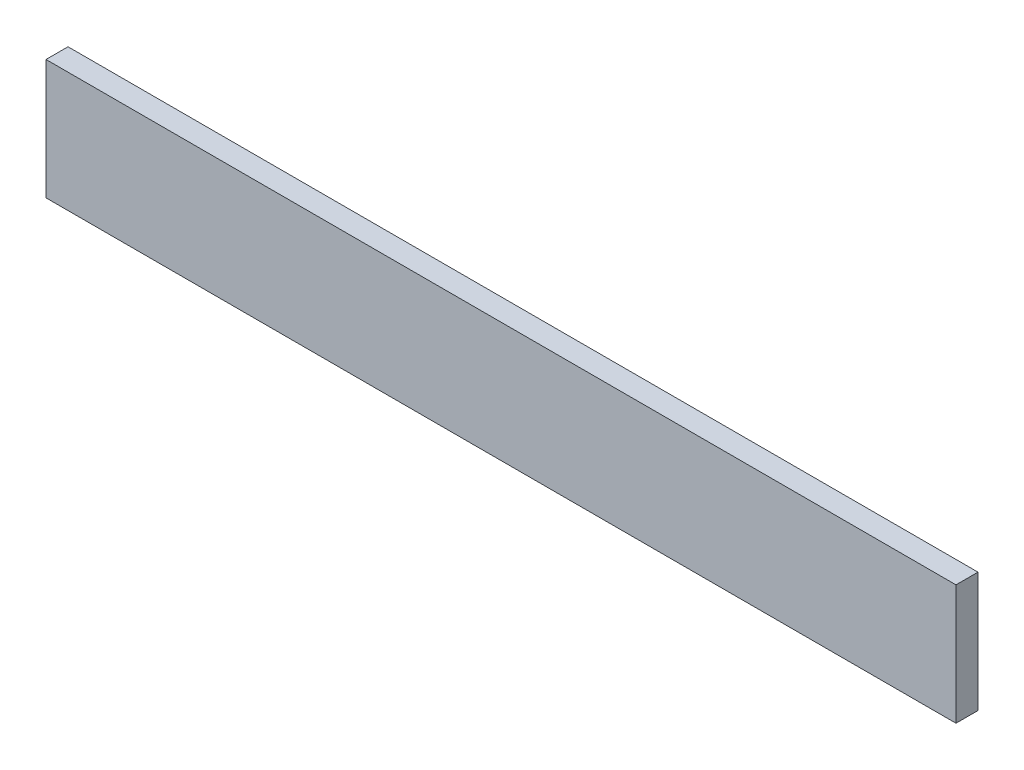
ISO-10303-21;
HEADER;
FILE_DESCRIPTION(('STEP AP214'),'2;1');
FILE_NAME('part.step','',(''),(''),'','','');
FILE_SCHEMA(('AUTOMOTIVE_DESIGN { 1 0 10303 214 1 1 1 1 }'));
ENDSEC;
DATA;
#1=APPLICATION_CONTEXT('core data for automotive mechanical design processes');
#2=APPLICATION_PROTOCOL_DEFINITION('international standard','automotive_design',2000,#1);
#3=PRODUCT_CONTEXT('',#1,'mechanical');
#4=PRODUCT('Part','Part','',(#3));
#5=PRODUCT_RELATED_PRODUCT_CATEGORY('part','',(#4));
#6=PRODUCT_DEFINITION_FORMATION('','',#4);
#7=PRODUCT_DEFINITION_CONTEXT('part definition',#1,'design');
#8=PRODUCT_DEFINITION('design','',#6,#7);
#9=PRODUCT_DEFINITION_SHAPE('','',#8);
#10=(LENGTH_UNIT() NAMED_UNIT(*) SI_UNIT(.MILLI.,.METRE.));
#11=(NAMED_UNIT(*) PLANE_ANGLE_UNIT() SI_UNIT($,.RADIAN.));
#12=(NAMED_UNIT(*) SI_UNIT($,.STERADIAN.) SOLID_ANGLE_UNIT());
#13=UNCERTAINTY_MEASURE_WITH_UNIT(LENGTH_MEASURE(1.E-05),#10,'distance_accuracy_value','');
#14=(GEOMETRIC_REPRESENTATION_CONTEXT(3) GLOBAL_UNCERTAINTY_ASSIGNED_CONTEXT((#13)) GLOBAL_UNIT_ASSIGNED_CONTEXT((#10,
#11,#12)) REPRESENTATION_CONTEXT('',''));
#15=CARTESIAN_POINT('',(0.,0.,0.));
#16=DIRECTION('',(0.,0.,1.));
#17=DIRECTION('',(1.,0.,0.));
#18=AXIS2_PLACEMENT_3D('',#15,#16,#17);
#19=CARTESIAN_POINT('',(-372.,-49.0000000000001,18.));
#20=DIRECTION('',(1.,0.,0.));
#21=DIRECTION('',(0.,0.,-1.));
#22=AXIS2_PLACEMENT_3D('',#19,#20,#21);
#23=PLANE('',#22);
#24=DIRECTION('',(0.,-1.,0.));
#25=VECTOR('',#24,1.);
#26=CARTESIAN_POINT('',(-372.,-49.0000000000001,0.));
#27=LINE('',#26,#25);
#28=CARTESIAN_POINT('',(-372.,48.9999999999999,0.));
#29=VERTEX_POINT('',#28);
#30=CARTESIAN_POINT('',(-372.,-49.0000000000001,0.));
#31=VERTEX_POINT('',#30);
#32=EDGE_CURVE('E96',#29,#31,#27,.T.);
#33=ORIENTED_EDGE('',*,*,#32,.T.);
#34=DIRECTION('',(0.,0.,-1.));
#35=VECTOR('',#34,1.);
#36=CARTESIAN_POINT('',(-372.,-49.0000000000001,18.));
#37=LINE('',#36,#35);
#38=CARTESIAN_POINT('',(-372.,-49.0000000000001,18.));
#39=VERTEX_POINT('',#38);
#40=EDGE_CURVE('E11',#39,#31,#37,.T.);
#41=ORIENTED_EDGE('',*,*,#40,.F.);
#42=DIRECTION('',(0.,-1.,0.));
#43=VECTOR('',#42,1.);
#44=CARTESIAN_POINT('',(-372.,-49.0000000000001,18.));
#45=LINE('',#44,#43);
#46=CARTESIAN_POINT('',(-372.,48.9999999999999,18.));
#47=VERTEX_POINT('',#46);
#48=EDGE_CURVE('E84',#47,#39,#45,.T.);
#49=ORIENTED_EDGE('',*,*,#48,.F.);
#50=DIRECTION('',(0.,0.,-1.));
#51=VECTOR('',#50,1.);
#52=CARTESIAN_POINT('',(-372.,48.9999999999999,18.));
#53=LINE('',#52,#51);
#54=EDGE_CURVE('E92',#47,#29,#53,.T.);
#55=ORIENTED_EDGE('',*,*,#54,.T.);
#56=EDGE_LOOP('',(#33,#41,#49,#55));
#57=FACE_BOUND('',#56,.T.);
#58=ADVANCED_FACE('F33',(#57),#23,.F.);
#59=CARTESIAN_POINT('',(372.,-49.,18.));
#60=DIRECTION('',(0.,1.,0.));
#61=DIRECTION('',(-1.,0.,0.));
#62=AXIS2_PLACEMENT_3D('',#59,#60,#61);
#63=PLANE('',#62);
#64=DIRECTION('',(1.,0.,0.));
#65=VECTOR('',#64,1.);
#66=CARTESIAN_POINT('',(372.,-49.,0.));
#67=LINE('',#66,#65);
#68=CARTESIAN_POINT('',(372.,-49.,0.));
#69=VERTEX_POINT('',#68);
#70=EDGE_CURVE('E88',#31,#69,#67,.T.);
#71=ORIENTED_EDGE('',*,*,#70,.T.);
#72=DIRECTION('',(0.,0.,-1.));
#73=VECTOR('',#72,1.);
#74=CARTESIAN_POINT('',(372.,-49.,18.));
#75=LINE('',#74,#73);
#76=CARTESIAN_POINT('',(372.,-49.,18.));
#77=VERTEX_POINT('',#76);
#78=EDGE_CURVE('E41',#77,#69,#75,.T.);
#79=ORIENTED_EDGE('',*,*,#78,.F.);
#80=DIRECTION('',(1.,0.,0.));
#81=VECTOR('',#80,1.);
#82=CARTESIAN_POINT('',(372.,-49.,18.));
#83=LINE('',#82,#81);
#84=EDGE_CURVE('E79',#39,#77,#83,.T.);
#85=ORIENTED_EDGE('',*,*,#84,.F.);
#86=ORIENTED_EDGE('',*,*,#40,.T.);
#87=EDGE_LOOP('',(#71,#79,#85,#86));
#88=FACE_BOUND('',#87,.T.);
#89=ADVANCED_FACE('F87',(#88),#63,.F.);
#90=CARTESIAN_POINT('',(372.,-49.,18.));
#91=DIRECTION('',(-1.,0.,0.));
#92=DIRECTION('',(0.,0.,1.));
#93=AXIS2_PLACEMENT_3D('',#90,#91,#92);
#94=PLANE('',#93);
#95=DIRECTION('',(0.,1.,0.));
#96=VECTOR('',#95,1.);
#97=CARTESIAN_POINT('',(372.,-49.,0.));
#98=LINE('',#97,#96);
#99=CARTESIAN_POINT('',(372.,49.,0.));
#100=VERTEX_POINT('',#99);
#101=EDGE_CURVE('E66',#69,#100,#98,.T.);
#102=ORIENTED_EDGE('',*,*,#101,.T.);
#103=DIRECTION('',(0.,0.,-1.));
#104=VECTOR('',#103,1.);
#105=CARTESIAN_POINT('',(372.,49.,18.));
#106=LINE('',#105,#104);
#107=CARTESIAN_POINT('',(372.,49.,18.));
#108=VERTEX_POINT('',#107);
#109=EDGE_CURVE('E89',#108,#100,#106,.T.);
#110=ORIENTED_EDGE('',*,*,#109,.F.);
#111=DIRECTION('',(0.,1.,0.));
#112=VECTOR('',#111,1.);
#113=CARTESIAN_POINT('',(372.,-49.,18.));
#114=LINE('',#113,#112);
#115=EDGE_CURVE('E82',#77,#108,#114,.T.);
#116=ORIENTED_EDGE('',*,*,#115,.F.);
#117=ORIENTED_EDGE('',*,*,#78,.T.);
#118=EDGE_LOOP('',(#102,#110,#116,#117));
#119=FACE_BOUND('',#118,.T.);
#120=ADVANCED_FACE('F90',(#119),#94,.F.);
#121=CARTESIAN_POINT('',(372.,49.,18.));
#122=DIRECTION('',(0.,-1.,0.));
#123=DIRECTION('',(1.,0.,0.));
#124=AXIS2_PLACEMENT_3D('',#121,#122,#123);
#125=PLANE('',#124);
#126=DIRECTION('',(-1.,0.,0.));
#127=VECTOR('',#126,1.);
#128=CARTESIAN_POINT('',(372.,49.,0.));
#129=LINE('',#128,#127);
#130=EDGE_CURVE('E72',#100,#29,#129,.T.);
#131=ORIENTED_EDGE('',*,*,#130,.T.);
#132=ORIENTED_EDGE('',*,*,#54,.F.);
#133=DIRECTION('',(-1.,0.,0.));
#134=VECTOR('',#133,1.);
#135=CARTESIAN_POINT('',(372.,49.,18.));
#136=LINE('',#135,#134);
#137=EDGE_CURVE('E49',#108,#47,#136,.T.);
#138=ORIENTED_EDGE('',*,*,#137,.F.);
#139=ORIENTED_EDGE('',*,*,#109,.T.);
#140=EDGE_LOOP('',(#131,#132,#138,#139));
#141=FACE_BOUND('',#140,.T.);
#142=ADVANCED_FACE('F103',(#141),#125,.F.);
#143=CARTESIAN_POINT('',(0.,0.,18.));
#144=DIRECTION('',(0.,0.,1.));
#145=DIRECTION('',(1.,0.,0.));
#146=AXIS2_PLACEMENT_3D('',#143,#144,#145);
#147=PLANE('',#146);
#148=ORIENTED_EDGE('',*,*,#48,.T.);
#149=ORIENTED_EDGE('',*,*,#84,.T.);
#150=ORIENTED_EDGE('',*,*,#115,.T.);
#151=ORIENTED_EDGE('',*,*,#137,.T.);
#152=EDGE_LOOP('',(#148,#149,#150,#151));
#153=FACE_BOUND('',#152,.T.);
#154=ADVANCED_FACE('F80',(#153),#147,.T.);
#155=CARTESIAN_POINT('',(0.,0.,0.));
#156=DIRECTION('',(0.,0.,1.));
#157=DIRECTION('',(1.,0.,0.));
#158=AXIS2_PLACEMENT_3D('',#155,#156,#157);
#159=PLANE('',#158);
#160=ORIENTED_EDGE('',*,*,#32,.F.);
#161=ORIENTED_EDGE('',*,*,#130,.F.);
#162=ORIENTED_EDGE('',*,*,#101,.F.);
#163=ORIENTED_EDGE('',*,*,#70,.F.);
#164=EDGE_LOOP('',(#160,#161,#162,#163));
#165=FACE_BOUND('',#164,.T.);
#166=ADVANCED_FACE('F106',(#165),#159,.F.);
#167=CLOSED_SHELL('',(#58,#89,#120,#142,#154,#166));
#168=MANIFOLD_SOLID_BREP('B2',#167);
#169=ADVANCED_BREP_SHAPE_REPRESENTATION('',(#18,#168),#14);
#170=SHAPE_DEFINITION_REPRESENTATION(#9,#169);
ENDSEC;
END-ISO-10303-21;
